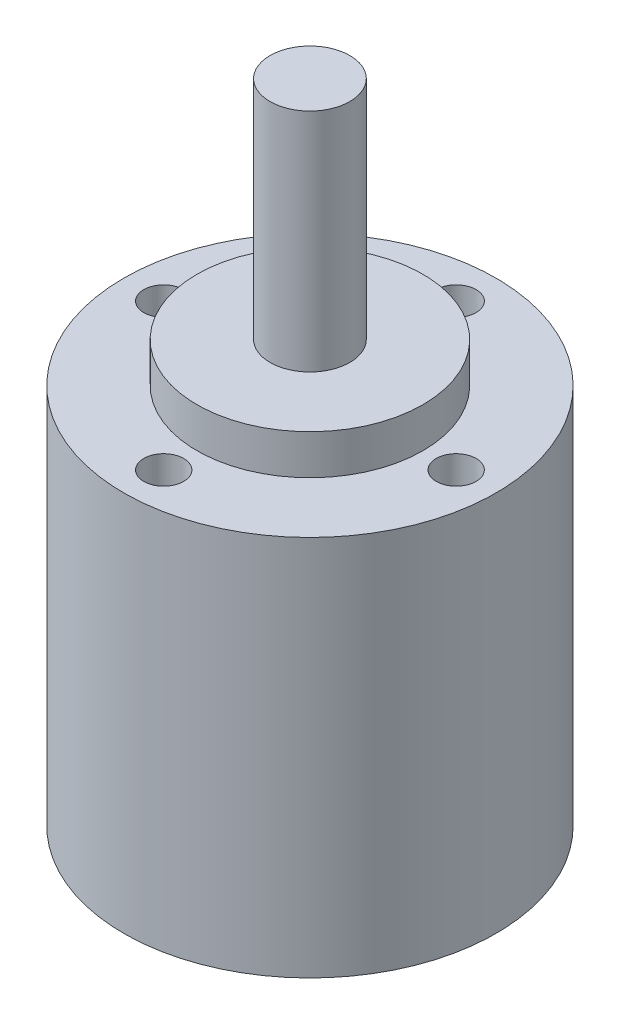
ISO-10303-21;
HEADER;
FILE_DESCRIPTION(('STEP AP214'),'2;1');
FILE_NAME('part.step','',(''),(''),'','','');
FILE_SCHEMA(('AUTOMOTIVE_DESIGN { 1 0 10303 214 1 1 1 1 }'));
ENDSEC;
DATA;
#1=APPLICATION_CONTEXT('core data for automotive mechanical design processes');
#2=APPLICATION_PROTOCOL_DEFINITION('international standard','automotive_design',2000,#1);
#3=PRODUCT_CONTEXT('',#1,'mechanical');
#4=PRODUCT('Part','Part','',(#3));
#5=PRODUCT_RELATED_PRODUCT_CATEGORY('part','',(#4));
#6=PRODUCT_DEFINITION_FORMATION('','',#4);
#7=PRODUCT_DEFINITION_CONTEXT('part definition',#1,'design');
#8=PRODUCT_DEFINITION('design','',#6,#7);
#9=PRODUCT_DEFINITION_SHAPE('','',#8);
#10=(LENGTH_UNIT() NAMED_UNIT(*) SI_UNIT(.MILLI.,.METRE.));
#11=(NAMED_UNIT(*) PLANE_ANGLE_UNIT() SI_UNIT($,.RADIAN.));
#12=(NAMED_UNIT(*) SI_UNIT($,.STERADIAN.) SOLID_ANGLE_UNIT());
#13=UNCERTAINTY_MEASURE_WITH_UNIT(LENGTH_MEASURE(1.E-05),#10,'distance_accuracy_value','');
#14=(GEOMETRIC_REPRESENTATION_CONTEXT(3) GLOBAL_UNCERTAINTY_ASSIGNED_CONTEXT((#13)) GLOBAL_UNIT_ASSIGNED_CONTEXT((#10,
#11,#12)) REPRESENTATION_CONTEXT('',''));
#15=CARTESIAN_POINT('',(0.,0.,0.));
#16=DIRECTION('',(0.,0.,1.));
#17=DIRECTION('',(1.,0.,0.));
#18=AXIS2_PLACEMENT_3D('',#15,#16,#17);
#19=CARTESIAN_POINT('',(0.,-28.7,0.));
#20=DIRECTION('',(0.,1.,0.));
#21=DIRECTION('',(1.,0.,0.));
#22=AXIS2_PLACEMENT_3D('',#19,#20,#21);
#23=PLANE('',#22);
#24=CARTESIAN_POINT('',(0.,-28.7,0.));
#25=DIRECTION('',(0.,-1.,0.));
#26=DIRECTION('',(1.,0.,0.));
#27=AXIS2_PLACEMENT_3D('',#24,#25,#26);
#28=CIRCLE('',#27,14.);
#29=CARTESIAN_POINT('',(-14.,-28.7,0.));
#30=VERTEX_POINT('',#29);
#31=EDGE_CURVE('E129',#30,#30,#28,.T.);
#32=ORIENTED_EDGE('',*,*,#31,.T.);
#33=EDGE_LOOP('',(#32));
#34=FACE_BOUND('',#33,.T.);
#35=ADVANCED_FACE('F16',(#34),#23,.F.);
#36=CARTESIAN_POINT('',(0.,0.,0.));
#37=DIRECTION('',(0.,1.,0.));
#38=DIRECTION('',(1.,0.,0.));
#39=AXIS2_PLACEMENT_3D('',#36,#37,#38);
#40=PLANE('',#39);
#41=CARTESIAN_POINT('',(0.,0.,0.));
#42=DIRECTION('',(0.,-1.,0.));
#43=DIRECTION('',(1.,0.,0.));
#44=AXIS2_PLACEMENT_3D('',#41,#42,#43);
#45=CIRCLE('',#44,8.5);
#46=CARTESIAN_POINT('',(-8.5,0.,0.));
#47=VERTEX_POINT('',#46);
#48=EDGE_CURVE('E133',#47,#47,#45,.T.);
#49=ORIENTED_EDGE('',*,*,#48,.T.);
#50=EDGE_LOOP('',(#49));
#51=FACE_BOUND('',#50,.T.);
#52=CARTESIAN_POINT('',(0.,0.,11.));
#53=DIRECTION('',(0.,-1.,0.));
#54=DIRECTION('',(-1.,0.,0.));
#55=AXIS2_PLACEMENT_3D('',#52,#53,#54);
#56=CIRCLE('',#55,1.5);
#57=CARTESIAN_POINT('',(1.5,0.,11.));
#58=VERTEX_POINT('',#57);
#59=EDGE_CURVE('E128',#58,#58,#56,.T.);
#60=ORIENTED_EDGE('',*,*,#59,.T.);
#61=EDGE_LOOP('',(#60));
#62=FACE_BOUND('',#61,.T.);
#63=CARTESIAN_POINT('',(0.,0.,-11.));
#64=DIRECTION('',(0.,-1.,0.));
#65=DIRECTION('',(-1.,0.,0.));
#66=AXIS2_PLACEMENT_3D('',#63,#64,#65);
#67=CIRCLE('',#66,1.5);
#68=CARTESIAN_POINT('',(1.5,0.,-11.));
#69=VERTEX_POINT('',#68);
#70=EDGE_CURVE('E110',#69,#69,#67,.T.);
#71=ORIENTED_EDGE('',*,*,#70,.T.);
#72=EDGE_LOOP('',(#71));
#73=FACE_BOUND('',#72,.T.);
#74=CARTESIAN_POINT('',(11.,0.,0.));
#75=DIRECTION('',(0.,-1.,0.));
#76=DIRECTION('',(-1.,0.,0.));
#77=AXIS2_PLACEMENT_3D('',#74,#75,#76);
#78=CIRCLE('',#77,1.5);
#79=CARTESIAN_POINT('',(12.5,0.,0.));
#80=VERTEX_POINT('',#79);
#81=EDGE_CURVE('E91',#80,#80,#78,.T.);
#82=ORIENTED_EDGE('',*,*,#81,.T.);
#83=EDGE_LOOP('',(#82));
#84=FACE_BOUND('',#83,.T.);
#85=CARTESIAN_POINT('',(-11.,0.,0.));
#86=DIRECTION('',(0.,-1.,0.));
#87=DIRECTION('',(-1.,0.,0.));
#88=AXIS2_PLACEMENT_3D('',#85,#86,#87);
#89=CIRCLE('',#88,1.5);
#90=CARTESIAN_POINT('',(-9.5,0.,0.));
#91=VERTEX_POINT('',#90);
#92=EDGE_CURVE('E137',#91,#91,#89,.T.);
#93=ORIENTED_EDGE('',*,*,#92,.T.);
#94=EDGE_LOOP('',(#93));
#95=FACE_BOUND('',#94,.T.);
#96=CARTESIAN_POINT('',(0.,0.,0.));
#97=DIRECTION('',(0.,1.,0.));
#98=DIRECTION('',(1.,0.,0.));
#99=AXIS2_PLACEMENT_3D('',#96,#97,#98);
#100=CIRCLE('',#99,14.);
#101=CARTESIAN_POINT('',(-14.,0.,0.));
#102=VERTEX_POINT('',#101);
#103=EDGE_CURVE('E11',#102,#102,#100,.T.);
#104=ORIENTED_EDGE('',*,*,#103,.T.);
#105=EDGE_LOOP('',(#104));
#106=FACE_BOUND('',#105,.T.);
#107=ADVANCED_FACE('F18',(#51,#62,#73,#84,#95,#106),#40,.T.);
#108=CARTESIAN_POINT('',(0.,0.,0.));
#109=DIRECTION('',(0.,-1.,0.));
#110=DIRECTION('',(1.,0.,0.));
#111=AXIS2_PLACEMENT_3D('',#108,#109,#110);
#112=CYLINDRICAL_SURFACE('',#111,14.);
#113=ORIENTED_EDGE('',*,*,#31,.F.);
#114=DIRECTION('',(0.,1.,0.));
#115=VECTOR('',#114,1.);
#116=CARTESIAN_POINT('',(-14.,0.,0.));
#117=LINE('',#116,#115);
#118=EDGE_CURVE('E20',#30,#102,#117,.T.);
#119=ORIENTED_EDGE('',*,*,#118,.T.);
#120=ORIENTED_EDGE('',*,*,#103,.F.);
#121=ORIENTED_EDGE('',*,*,#118,.F.);
#122=EDGE_LOOP('',(#113,#119,#120,#121));
#123=FACE_BOUND('',#122,.T.);
#124=ADVANCED_FACE('F239',(#123),#112,.T.);
#125=CARTESIAN_POINT('',(0.,3.,0.));
#126=DIRECTION('',(0.,1.,0.));
#127=DIRECTION('',(1.,0.,0.));
#128=AXIS2_PLACEMENT_3D('',#125,#126,#127);
#129=PLANE('',#128);
#130=CARTESIAN_POINT('',(0.,3.,0.));
#131=DIRECTION('',(0.,-1.,0.));
#132=DIRECTION('',(1.,0.,0.));
#133=AXIS2_PLACEMENT_3D('',#130,#131,#132);
#134=CIRCLE('',#133,3.);
#135=CARTESIAN_POINT('',(-3.,3.,0.));
#136=VERTEX_POINT('',#135);
#137=EDGE_CURVE('E108',#136,#136,#134,.T.);
#138=ORIENTED_EDGE('',*,*,#137,.T.);
#139=EDGE_LOOP('',(#138));
#140=FACE_BOUND('',#139,.T.);
#141=CARTESIAN_POINT('',(0.,3.,0.));
#142=DIRECTION('',(0.,1.,0.));
#143=DIRECTION('',(1.,0.,0.));
#144=AXIS2_PLACEMENT_3D('',#141,#142,#143);
#145=CIRCLE('',#144,8.5);
#146=CARTESIAN_POINT('',(-8.5,3.,0.));
#147=VERTEX_POINT('',#146);
#148=EDGE_CURVE('E147',#147,#147,#145,.T.);
#149=ORIENTED_EDGE('',*,*,#148,.T.);
#150=EDGE_LOOP('',(#149));
#151=FACE_BOUND('',#150,.T.);
#152=ADVANCED_FACE('F256',(#140,#151),#129,.T.);
#153=CARTESIAN_POINT('',(0.,0.,0.));
#154=DIRECTION('',(0.,1.,0.));
#155=DIRECTION('',(1.,0.,0.));
#156=AXIS2_PLACEMENT_3D('',#153,#154,#155);
#157=CYLINDRICAL_SURFACE('',#156,8.5);
#158=ORIENTED_EDGE('',*,*,#148,.F.);
#159=DIRECTION('',(0.,-1.,0.));
#160=VECTOR('',#159,1.);
#161=CARTESIAN_POINT('',(-8.5,0.,0.));
#162=LINE('',#161,#160);
#163=EDGE_CURVE('E140',#147,#47,#162,.T.);
#164=ORIENTED_EDGE('',*,*,#163,.T.);
#165=ORIENTED_EDGE('',*,*,#48,.F.);
#166=ORIENTED_EDGE('',*,*,#163,.F.);
#167=EDGE_LOOP('',(#158,#164,#165,#166));
#168=FACE_BOUND('',#167,.T.);
#169=ADVANCED_FACE('F330',(#168),#157,.T.);
#170=CARTESIAN_POINT('',(0.,20.,0.));
#171=DIRECTION('',(0.,1.,0.));
#172=DIRECTION('',(1.,0.,0.));
#173=AXIS2_PLACEMENT_3D('',#170,#171,#172);
#174=PLANE('',#173);
#175=CARTESIAN_POINT('',(0.,20.,0.));
#176=DIRECTION('',(0.,1.,0.));
#177=DIRECTION('',(1.,0.,0.));
#178=AXIS2_PLACEMENT_3D('',#175,#176,#177);
#179=CIRCLE('',#178,3.);
#180=CARTESIAN_POINT('',(-3.,20.,0.));
#181=VERTEX_POINT('',#180);
#182=EDGE_CURVE('E151',#181,#181,#179,.T.);
#183=ORIENTED_EDGE('',*,*,#182,.T.);
#184=EDGE_LOOP('',(#183));
#185=FACE_BOUND('',#184,.T.);
#186=ADVANCED_FACE('F172',(#185),#174,.T.);
#187=CARTESIAN_POINT('',(0.,0.,0.));
#188=DIRECTION('',(0.,1.,0.));
#189=DIRECTION('',(1.,0.,0.));
#190=AXIS2_PLACEMENT_3D('',#187,#188,#189);
#191=CYLINDRICAL_SURFACE('',#190,3.);
#192=ORIENTED_EDGE('',*,*,#182,.F.);
#193=DIRECTION('',(0.,-1.,0.));
#194=VECTOR('',#193,1.);
#195=CARTESIAN_POINT('',(-3.,0.,0.));
#196=LINE('',#195,#194);
#197=EDGE_CURVE('E162',#181,#136,#196,.T.);
#198=ORIENTED_EDGE('',*,*,#197,.T.);
#199=ORIENTED_EDGE('',*,*,#137,.F.);
#200=ORIENTED_EDGE('',*,*,#197,.F.);
#201=EDGE_LOOP('',(#192,#198,#199,#200));
#202=FACE_BOUND('',#201,.T.);
#203=ADVANCED_FACE('F174',(#202),#191,.T.);
#204=CARTESIAN_POINT('',(0.,-7.5,11.));
#205=DIRECTION('',(0.,1.,0.));
#206=DIRECTION('',(1.,0.,0.));
#207=AXIS2_PLACEMENT_3D('',#204,#205,#206);
#208=PLANE('',#207);
#209=CARTESIAN_POINT('',(0.,-7.5,11.));
#210=DIRECTION('',(0.,-1.,0.));
#211=DIRECTION('',(-1.,0.,0.));
#212=AXIS2_PLACEMENT_3D('',#209,#210,#211);
#213=CIRCLE('',#212,1.5);
#214=CARTESIAN_POINT('',(1.5,-7.5,11.));
#215=VERTEX_POINT('',#214);
#216=EDGE_CURVE('E148',#215,#215,#213,.T.);
#217=ORIENTED_EDGE('',*,*,#216,.F.);
#218=EDGE_LOOP('',(#217));
#219=FACE_BOUND('',#218,.T.);
#220=ADVANCED_FACE('F309',(#219),#208,.T.);
#221=CARTESIAN_POINT('',(0.,0.,11.));
#222=DIRECTION('',(0.,-1.,0.));
#223=DIRECTION('',(-1.,0.,0.));
#224=AXIS2_PLACEMENT_3D('',#221,#222,#223);
#225=CYLINDRICAL_SURFACE('',#224,1.5);
#226=ORIENTED_EDGE('',*,*,#59,.F.);
#227=DIRECTION('',(0.,-1.,0.));
#228=VECTOR('',#227,1.);
#229=CARTESIAN_POINT('',(1.5,0.,11.));
#230=LINE('',#229,#228);
#231=EDGE_CURVE('E152',#58,#215,#230,.T.);
#232=ORIENTED_EDGE('',*,*,#231,.T.);
#233=ORIENTED_EDGE('',*,*,#216,.T.);
#234=ORIENTED_EDGE('',*,*,#231,.F.);
#235=EDGE_LOOP('',(#226,#232,#233,#234));
#236=FACE_BOUND('',#235,.T.);
#237=ADVANCED_FACE('F266',(#236),#225,.F.);
#238=CARTESIAN_POINT('',(0.,-7.5,-11.));
#239=DIRECTION('',(0.,1.,0.));
#240=DIRECTION('',(1.,0.,0.));
#241=AXIS2_PLACEMENT_3D('',#238,#239,#240);
#242=PLANE('',#241);
#243=CARTESIAN_POINT('',(0.,-7.5,-11.));
#244=DIRECTION('',(0.,-1.,0.));
#245=DIRECTION('',(-1.,0.,0.));
#246=AXIS2_PLACEMENT_3D('',#243,#244,#245);
#247=CIRCLE('',#246,1.5);
#248=CARTESIAN_POINT('',(1.5,-7.5,-11.));
#249=VERTEX_POINT('',#248);
#250=EDGE_CURVE('E121',#249,#249,#247,.T.);
#251=ORIENTED_EDGE('',*,*,#250,.F.);
#252=EDGE_LOOP('',(#251));
#253=FACE_BOUND('',#252,.T.);
#254=ADVANCED_FACE('F262',(#253),#242,.T.);
#255=CARTESIAN_POINT('',(0.,0.,-11.));
#256=DIRECTION('',(0.,-1.,0.));
#257=DIRECTION('',(-1.,0.,0.));
#258=AXIS2_PLACEMENT_3D('',#255,#256,#257);
#259=CYLINDRICAL_SURFACE('',#258,1.5);
#260=ORIENTED_EDGE('',*,*,#70,.F.);
#261=DIRECTION('',(0.,-1.,0.));
#262=VECTOR('',#261,1.);
#263=CARTESIAN_POINT('',(1.5,0.,-11.));
#264=LINE('',#263,#262);
#265=EDGE_CURVE('E113',#69,#249,#264,.T.);
#266=ORIENTED_EDGE('',*,*,#265,.T.);
#267=ORIENTED_EDGE('',*,*,#250,.T.);
#268=ORIENTED_EDGE('',*,*,#265,.F.);
#269=EDGE_LOOP('',(#260,#266,#267,#268));
#270=FACE_BOUND('',#269,.T.);
#271=ADVANCED_FACE('F248',(#270),#259,.F.);
#272=CARTESIAN_POINT('',(11.,-7.5,0.));
#273=DIRECTION('',(0.,1.,0.));
#274=DIRECTION('',(1.,0.,0.));
#275=AXIS2_PLACEMENT_3D('',#272,#273,#274);
#276=PLANE('',#275);
#277=CARTESIAN_POINT('',(11.,-7.5,0.));
#278=DIRECTION('',(0.,-1.,0.));
#279=DIRECTION('',(-1.,0.,0.));
#280=AXIS2_PLACEMENT_3D('',#277,#278,#279);
#281=CIRCLE('',#280,1.5);
#282=CARTESIAN_POINT('',(12.5,-7.5,0.));
#283=VERTEX_POINT('',#282);
#284=EDGE_CURVE('E93',#283,#283,#281,.T.);
#285=ORIENTED_EDGE('',*,*,#284,.F.);
#286=EDGE_LOOP('',(#285));
#287=FACE_BOUND('',#286,.T.);
#288=ADVANCED_FACE('F244',(#287),#276,.T.);
#289=CARTESIAN_POINT('',(11.,0.,0.));
#290=DIRECTION('',(0.,-1.,0.));
#291=DIRECTION('',(-1.,0.,0.));
#292=AXIS2_PLACEMENT_3D('',#289,#290,#291);
#293=CYLINDRICAL_SURFACE('',#292,1.5);
#294=ORIENTED_EDGE('',*,*,#81,.F.);
#295=DIRECTION('',(0.,-1.,0.));
#296=VECTOR('',#295,1.);
#297=CARTESIAN_POINT('',(12.5,0.,0.));
#298=LINE('',#297,#296);
#299=EDGE_CURVE('E88',#80,#283,#298,.T.);
#300=ORIENTED_EDGE('',*,*,#299,.T.);
#301=ORIENTED_EDGE('',*,*,#284,.T.);
#302=ORIENTED_EDGE('',*,*,#299,.F.);
#303=EDGE_LOOP('',(#294,#300,#301,#302));
#304=FACE_BOUND('',#303,.T.);
#305=ADVANCED_FACE('F90',(#304),#293,.F.);
#306=CARTESIAN_POINT('',(-11.,-7.5,0.));
#307=DIRECTION('',(0.,1.,0.));
#308=DIRECTION('',(1.,0.,0.));
#309=AXIS2_PLACEMENT_3D('',#306,#307,#308);
#310=PLANE('',#309);
#311=CARTESIAN_POINT('',(-11.,-7.5,0.));
#312=DIRECTION('',(0.,-1.,0.));
#313=DIRECTION('',(-1.,0.,0.));
#314=AXIS2_PLACEMENT_3D('',#311,#312,#313);
#315=CIRCLE('',#314,1.5);
#316=CARTESIAN_POINT('',(-9.5,-7.5,0.));
#317=VERTEX_POINT('',#316);
#318=EDGE_CURVE('E99',#317,#317,#315,.T.);
#319=ORIENTED_EDGE('',*,*,#318,.F.);
#320=EDGE_LOOP('',(#319));
#321=FACE_BOUND('',#320,.T.);
#322=ADVANCED_FACE('F280',(#321),#310,.T.);
#323=CARTESIAN_POINT('',(-11.,0.,0.));
#324=DIRECTION('',(0.,-1.,0.));
#325=DIRECTION('',(-1.,0.,0.));
#326=AXIS2_PLACEMENT_3D('',#323,#324,#325);
#327=CYLINDRICAL_SURFACE('',#326,1.5);
#328=ORIENTED_EDGE('',*,*,#92,.F.);
#329=DIRECTION('',(0.,-1.,0.));
#330=VECTOR('',#329,1.);
#331=CARTESIAN_POINT('',(-9.5,0.,0.));
#332=LINE('',#331,#330);
#333=EDGE_CURVE('E105',#91,#317,#332,.T.);
#334=ORIENTED_EDGE('',*,*,#333,.T.);
#335=ORIENTED_EDGE('',*,*,#318,.T.);
#336=ORIENTED_EDGE('',*,*,#333,.F.);
#337=EDGE_LOOP('',(#328,#334,#335,#336));
#338=FACE_BOUND('',#337,.T.);
#339=ADVANCED_FACE('F284',(#338),#327,.F.);
#340=CLOSED_SHELL('',(#35,#107,#124,#152,#169,#186,#203,#220,#237,#254,#271,#288,#305,#322,#339));
#341=MANIFOLD_SOLID_BREP('B1',#340);
#342=ADVANCED_BREP_SHAPE_REPRESENTATION('',(#18,#341),#14);
#343=SHAPE_DEFINITION_REPRESENTATION(#9,#342);
ENDSEC;
END-ISO-10303-21;
